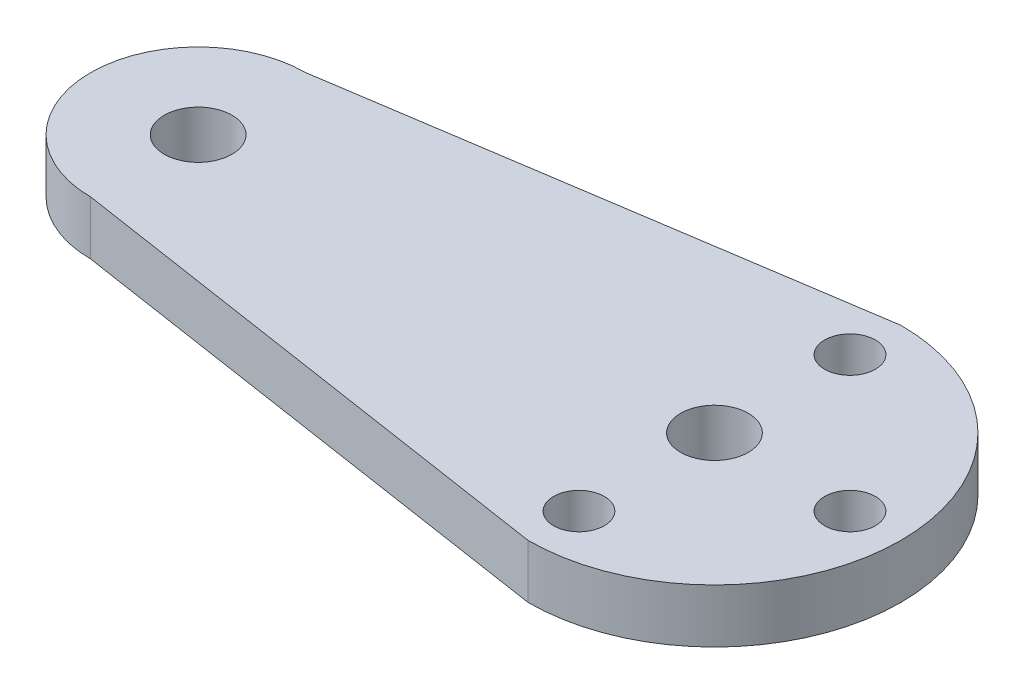
ISO-10303-21;
HEADER;
FILE_DESCRIPTION(('STEP AP214'),'2;1');
FILE_NAME('part.step','',(''),(''),'','','');
FILE_SCHEMA(('AUTOMOTIVE_DESIGN { 1 0 10303 214 1 1 1 1 }'));
ENDSEC;
DATA;
#1=APPLICATION_CONTEXT('core data for automotive mechanical design processes');
#2=APPLICATION_PROTOCOL_DEFINITION('international standard','automotive_design',2000,#1);
#3=PRODUCT_CONTEXT('',#1,'mechanical');
#4=PRODUCT('Part','Part','',(#3));
#5=PRODUCT_RELATED_PRODUCT_CATEGORY('part','',(#4));
#6=PRODUCT_DEFINITION_FORMATION('','',#4);
#7=PRODUCT_DEFINITION_CONTEXT('part definition',#1,'design');
#8=PRODUCT_DEFINITION('design','',#6,#7);
#9=PRODUCT_DEFINITION_SHAPE('','',#8);
#10=(LENGTH_UNIT() NAMED_UNIT(*) SI_UNIT(.MILLI.,.METRE.));
#11=(NAMED_UNIT(*) PLANE_ANGLE_UNIT() SI_UNIT($,.RADIAN.));
#12=(NAMED_UNIT(*) SI_UNIT($,.STERADIAN.) SOLID_ANGLE_UNIT());
#13=UNCERTAINTY_MEASURE_WITH_UNIT(LENGTH_MEASURE(1.E-05),#10,'distance_accuracy_value','');
#14=(GEOMETRIC_REPRESENTATION_CONTEXT(3) GLOBAL_UNCERTAINTY_ASSIGNED_CONTEXT((#13)) GLOBAL_UNIT_ASSIGNED_CONTEXT((#10,
#11,#12)) REPRESENTATION_CONTEXT('',''));
#15=CARTESIAN_POINT('',(0.,0.,0.));
#16=DIRECTION('',(0.,0.,1.));
#17=DIRECTION('',(1.,0.,0.));
#18=AXIS2_PLACEMENT_3D('',#15,#16,#17);
#19=CARTESIAN_POINT('',(15.24,3.175,0.));
#20=DIRECTION('',(0.,1.,0.));
#21=DIRECTION('',(0.,0.,1.));
#22=AXIS2_PLACEMENT_3D('',#19,#20,#21);
#23=PLANE('',#22);
#24=CARTESIAN_POINT('',(23.24,3.175,0.));
#25=DIRECTION('',(0.,1.,0.));
#26=DIRECTION('',(0.,0.,1.));
#27=AXIS2_PLACEMENT_3D('',#24,#25,#26);
#28=CIRCLE('',#27,1.5);
#29=CARTESIAN_POINT('',(23.24,3.175,1.5));
#30=VERTEX_POINT('',#29);
#31=EDGE_CURVE('E131',#30,#30,#28,.T.);
#32=ORIENTED_EDGE('',*,*,#31,.F.);
#33=EDGE_LOOP('',(#32));
#34=FACE_BOUND('',#33,.T.);
#35=CARTESIAN_POINT('',(-15.24,3.175,0.));
#36=DIRECTION('',(0.,1.,0.));
#37=DIRECTION('',(0.,0.,1.));
#38=AXIS2_PLACEMENT_3D('',#35,#36,#37);
#39=CIRCLE('',#38,2.000000064);
#40=CARTESIAN_POINT('',(-15.24,3.175,2.000000064));
#41=VERTEX_POINT('',#40);
#42=EDGE_CURVE('E119',#41,#41,#39,.T.);
#43=ORIENTED_EDGE('',*,*,#42,.F.);
#44=EDGE_LOOP('',(#43));
#45=FACE_BOUND('',#44,.T.);
#46=CARTESIAN_POINT('',(15.24,3.175,0.));
#47=DIRECTION('',(0.,1.,0.));
#48=DIRECTION('',(0.,0.,1.));
#49=AXIS2_PLACEMENT_3D('',#46,#47,#48);
#50=CIRCLE('',#49,11.);
#51=CARTESIAN_POINT('',(15.24,3.175,11.));
#52=VERTEX_POINT('',#51);
#53=CARTESIAN_POINT('',(15.24,3.175,-11.));
#54=VERTEX_POINT('',#53);
#55=EDGE_CURVE('E89',#52,#54,#50,.T.);
#56=ORIENTED_EDGE('',*,*,#55,.T.);
#57=DIRECTION('',(-0.988562140389916,0.,0.150814106063422));
#58=VECTOR('',#57,1.);
#59=CARTESIAN_POINT('',(-15.24,3.175,-6.35));
#60=LINE('',#59,#58);
#61=CARTESIAN_POINT('',(-15.24,3.175,-6.35));
#62=VERTEX_POINT('',#61);
#63=EDGE_CURVE('E84',#54,#62,#60,.T.);
#64=ORIENTED_EDGE('',*,*,#63,.T.);
#65=CARTESIAN_POINT('',(-15.24,3.175,0.));
#66=DIRECTION('',(0.,1.,0.));
#67=DIRECTION('',(0.,0.,-1.));
#68=AXIS2_PLACEMENT_3D('',#65,#66,#67);
#69=CIRCLE('',#68,6.35);
#70=CARTESIAN_POINT('',(-15.24,3.175,6.35));
#71=VERTEX_POINT('',#70);
#72=EDGE_CURVE('E87',#62,#71,#69,.T.);
#73=ORIENTED_EDGE('',*,*,#72,.T.);
#74=DIRECTION('',(0.988562140389916,0.,0.150814106063422));
#75=VECTOR('',#74,1.);
#76=CARTESIAN_POINT('',(15.24,3.175,11.));
#77=LINE('',#76,#75);
#78=EDGE_CURVE('E54',#71,#52,#77,.T.);
#79=ORIENTED_EDGE('',*,*,#78,.T.);
#80=EDGE_LOOP('',(#56,#64,#73,#79));
#81=FACE_BOUND('',#80,.T.);
#82=CARTESIAN_POINT('',(15.24,3.175,-8.00000000000001));
#83=DIRECTION('',(0.,1.,0.));
#84=DIRECTION('',(0.,0.,1.));
#85=AXIS2_PLACEMENT_3D('',#82,#83,#84);
#86=CIRCLE('',#85,1.5);
#87=CARTESIAN_POINT('',(15.24,3.175,-6.50000000000001));
#88=VERTEX_POINT('',#87);
#89=EDGE_CURVE('E104',#88,#88,#86,.T.);
#90=ORIENTED_EDGE('',*,*,#89,.F.);
#91=EDGE_LOOP('',(#90));
#92=FACE_BOUND('',#91,.T.);
#93=CARTESIAN_POINT('',(15.24,3.175,0.));
#94=DIRECTION('',(0.,1.,0.));
#95=DIRECTION('',(0.,0.,1.));
#96=AXIS2_PLACEMENT_3D('',#93,#94,#95);
#97=CIRCLE('',#96,2.000000064);
#98=CARTESIAN_POINT('',(15.24,3.175,2.000000064));
#99=VERTEX_POINT('',#98);
#100=EDGE_CURVE('E125',#99,#99,#97,.T.);
#101=ORIENTED_EDGE('',*,*,#100,.F.);
#102=EDGE_LOOP('',(#101));
#103=FACE_BOUND('',#102,.T.);
#104=CARTESIAN_POINT('',(15.24,3.175,7.99999999999999));
#105=DIRECTION('',(0.,1.,0.));
#106=DIRECTION('',(0.,0.,1.));
#107=AXIS2_PLACEMENT_3D('',#104,#105,#106);
#108=CIRCLE('',#107,1.5);
#109=CARTESIAN_POINT('',(15.24,3.175,9.49999999999999));
#110=VERTEX_POINT('',#109);
#111=EDGE_CURVE('E137',#110,#110,#108,.T.);
#112=ORIENTED_EDGE('',*,*,#111,.F.);
#113=EDGE_LOOP('',(#112));
#114=FACE_BOUND('',#113,.T.);
#115=ADVANCED_FACE('F37',(#34,#45,#81,#92,#103,#114),#23,.T.);
#116=CARTESIAN_POINT('',(15.24,0.,0.));
#117=DIRECTION('',(0.,1.,0.));
#118=DIRECTION('',(0.,0.,1.));
#119=AXIS2_PLACEMENT_3D('',#116,#117,#118);
#120=PLANE('',#119);
#121=CARTESIAN_POINT('',(15.24,0.,0.));
#122=DIRECTION('',(0.,1.,0.));
#123=DIRECTION('',(0.,0.,1.));
#124=AXIS2_PLACEMENT_3D('',#121,#122,#123);
#125=CIRCLE('',#124,11.);
#126=CARTESIAN_POINT('',(15.24,0.,11.));
#127=VERTEX_POINT('',#126);
#128=CARTESIAN_POINT('',(15.24,0.,-11.));
#129=VERTEX_POINT('',#128);
#130=EDGE_CURVE('E101',#127,#129,#125,.T.);
#131=ORIENTED_EDGE('',*,*,#130,.F.);
#132=DIRECTION('',(0.988562140389916,0.,0.150814106063422));
#133=VECTOR('',#132,1.);
#134=CARTESIAN_POINT('',(15.24,0.,11.));
#135=LINE('',#134,#133);
#136=CARTESIAN_POINT('',(-15.24,0.,6.35));
#137=VERTEX_POINT('',#136);
#138=EDGE_CURVE('E77',#137,#127,#135,.T.);
#139=ORIENTED_EDGE('',*,*,#138,.F.);
#140=CARTESIAN_POINT('',(-15.24,0.,0.));
#141=DIRECTION('',(0.,1.,0.));
#142=DIRECTION('',(0.,0.,-1.));
#143=AXIS2_PLACEMENT_3D('',#140,#141,#142);
#144=CIRCLE('',#143,6.35);
#145=CARTESIAN_POINT('',(-15.24,0.,-6.35));
#146=VERTEX_POINT('',#145);
#147=EDGE_CURVE('E71',#146,#137,#144,.T.);
#148=ORIENTED_EDGE('',*,*,#147,.F.);
#149=DIRECTION('',(-0.988562140389916,0.,0.150814106063422));
#150=VECTOR('',#149,1.);
#151=CARTESIAN_POINT('',(-15.24,0.,-6.35));
#152=LINE('',#151,#150);
#153=EDGE_CURVE('E93',#129,#146,#152,.T.);
#154=ORIENTED_EDGE('',*,*,#153,.F.);
#155=EDGE_LOOP('',(#131,#139,#148,#154));
#156=FACE_BOUND('',#155,.T.);
#157=CARTESIAN_POINT('',(15.24,0.,-8.00000000000001));
#158=DIRECTION('',(0.,1.,0.));
#159=DIRECTION('',(0.,0.,1.));
#160=AXIS2_PLACEMENT_3D('',#157,#158,#159);
#161=CIRCLE('',#160,1.5);
#162=CARTESIAN_POINT('',(15.24,0.,-6.50000000000001));
#163=VERTEX_POINT('',#162);
#164=EDGE_CURVE('E116',#163,#163,#161,.T.);
#165=ORIENTED_EDGE('',*,*,#164,.T.);
#166=EDGE_LOOP('',(#165));
#167=FACE_BOUND('',#166,.T.);
#168=CARTESIAN_POINT('',(-15.24,0.,0.));
#169=DIRECTION('',(0.,1.,0.));
#170=DIRECTION('',(0.,0.,1.));
#171=AXIS2_PLACEMENT_3D('',#168,#169,#170);
#172=CIRCLE('',#171,2.000000064);
#173=CARTESIAN_POINT('',(-15.24,0.,2.000000064));
#174=VERTEX_POINT('',#173);
#175=EDGE_CURVE('E122',#174,#174,#172,.T.);
#176=ORIENTED_EDGE('',*,*,#175,.T.);
#177=EDGE_LOOP('',(#176));
#178=FACE_BOUND('',#177,.T.);
#179=CARTESIAN_POINT('',(15.24,0.,0.));
#180=DIRECTION('',(0.,1.,0.));
#181=DIRECTION('',(0.,0.,1.));
#182=AXIS2_PLACEMENT_3D('',#179,#180,#181);
#183=CIRCLE('',#182,2.000000064);
#184=CARTESIAN_POINT('',(15.24,0.,2.000000064));
#185=VERTEX_POINT('',#184);
#186=EDGE_CURVE('E128',#185,#185,#183,.T.);
#187=ORIENTED_EDGE('',*,*,#186,.T.);
#188=EDGE_LOOP('',(#187));
#189=FACE_BOUND('',#188,.T.);
#190=CARTESIAN_POINT('',(23.24,0.,0.));
#191=DIRECTION('',(0.,1.,0.));
#192=DIRECTION('',(0.,0.,1.));
#193=AXIS2_PLACEMENT_3D('',#190,#191,#192);
#194=CIRCLE('',#193,1.5);
#195=CARTESIAN_POINT('',(23.24,0.,1.5));
#196=VERTEX_POINT('',#195);
#197=EDGE_CURVE('E134',#196,#196,#194,.T.);
#198=ORIENTED_EDGE('',*,*,#197,.T.);
#199=EDGE_LOOP('',(#198));
#200=FACE_BOUND('',#199,.T.);
#201=CARTESIAN_POINT('',(15.24,0.,7.99999999999999));
#202=DIRECTION('',(0.,1.,0.));
#203=DIRECTION('',(0.,0.,1.));
#204=AXIS2_PLACEMENT_3D('',#201,#202,#203);
#205=CIRCLE('',#204,1.5);
#206=CARTESIAN_POINT('',(15.24,0.,9.49999999999999));
#207=VERTEX_POINT('',#206);
#208=EDGE_CURVE('E140',#207,#207,#205,.T.);
#209=ORIENTED_EDGE('',*,*,#208,.T.);
#210=EDGE_LOOP('',(#209));
#211=FACE_BOUND('',#210,.T.);
#212=ADVANCED_FACE('F112',(#156,#167,#178,#189,#200,#211),#120,.F.);
#213=CARTESIAN_POINT('',(15.24,3.175,0.));
#214=DIRECTION('',(0.,-1.,0.));
#215=DIRECTION('',(0.,0.,-1.));
#216=AXIS2_PLACEMENT_3D('',#213,#214,#215);
#217=CYLINDRICAL_SURFACE('',#216,11.);
#218=ORIENTED_EDGE('',*,*,#130,.T.);
#219=DIRECTION('',(0.,-1.,0.));
#220=VECTOR('',#219,1.);
#221=CARTESIAN_POINT('',(15.24,3.175,-11.));
#222=LINE('',#221,#220);
#223=EDGE_CURVE('E11',#54,#129,#222,.T.);
#224=ORIENTED_EDGE('',*,*,#223,.F.);
#225=ORIENTED_EDGE('',*,*,#55,.F.);
#226=DIRECTION('',(0.,-1.,0.));
#227=VECTOR('',#226,1.);
#228=CARTESIAN_POINT('',(15.24,3.175,11.));
#229=LINE('',#228,#227);
#230=EDGE_CURVE('E97',#52,#127,#229,.T.);
#231=ORIENTED_EDGE('',*,*,#230,.T.);
#232=EDGE_LOOP('',(#218,#224,#225,#231));
#233=FACE_BOUND('',#232,.T.);
#234=ADVANCED_FACE('F39',(#233),#217,.T.);
#235=CARTESIAN_POINT('',(-15.24,3.175,-6.35));
#236=DIRECTION('',(0.150814106063422,0.,0.988562140389915));
#237=DIRECTION('',(0.988562140389916,0.,-0.150814106063422));
#238=AXIS2_PLACEMENT_3D('',#235,#236,#237);
#239=PLANE('',#238);
#240=ORIENTED_EDGE('',*,*,#153,.T.);
#241=DIRECTION('',(0.,-1.,0.));
#242=VECTOR('',#241,1.);
#243=CARTESIAN_POINT('',(-15.24,3.175,-6.35));
#244=LINE('',#243,#242);
#245=EDGE_CURVE('E46',#62,#146,#244,.T.);
#246=ORIENTED_EDGE('',*,*,#245,.F.);
#247=ORIENTED_EDGE('',*,*,#63,.F.);
#248=ORIENTED_EDGE('',*,*,#223,.T.);
#249=EDGE_LOOP('',(#240,#246,#247,#248));
#250=FACE_BOUND('',#249,.T.);
#251=ADVANCED_FACE('F92',(#250),#239,.F.);
#252=CARTESIAN_POINT('',(-15.24,3.175,0.));
#253=DIRECTION('',(0.,-1.,0.));
#254=DIRECTION('',(0.,0.,-1.));
#255=AXIS2_PLACEMENT_3D('',#252,#253,#254);
#256=CYLINDRICAL_SURFACE('',#255,6.35);
#257=ORIENTED_EDGE('',*,*,#147,.T.);
#258=DIRECTION('',(0.,-1.,0.));
#259=VECTOR('',#258,1.);
#260=CARTESIAN_POINT('',(-15.24,3.175,6.35));
#261=LINE('',#260,#259);
#262=EDGE_CURVE('E94',#71,#137,#261,.T.);
#263=ORIENTED_EDGE('',*,*,#262,.F.);
#264=ORIENTED_EDGE('',*,*,#72,.F.);
#265=ORIENTED_EDGE('',*,*,#245,.T.);
#266=EDGE_LOOP('',(#257,#263,#264,#265));
#267=FACE_BOUND('',#266,.T.);
#268=ADVANCED_FACE('F95',(#267),#256,.T.);
#269=CARTESIAN_POINT('',(15.24,3.175,11.));
#270=DIRECTION('',(0.150814106063422,0.,-0.988562140389915));
#271=DIRECTION('',(-0.988562140389916,0.,-0.150814106063422));
#272=AXIS2_PLACEMENT_3D('',#269,#270,#271);
#273=PLANE('',#272);
#274=ORIENTED_EDGE('',*,*,#138,.T.);
#275=ORIENTED_EDGE('',*,*,#230,.F.);
#276=ORIENTED_EDGE('',*,*,#78,.F.);
#277=ORIENTED_EDGE('',*,*,#262,.T.);
#278=EDGE_LOOP('',(#274,#275,#276,#277));
#279=FACE_BOUND('',#278,.T.);
#280=ADVANCED_FACE('F109',(#279),#273,.F.);
#281=CARTESIAN_POINT('',(15.24,3.175,-8.00000000000001));
#282=DIRECTION('',(0.,-1.,0.));
#283=DIRECTION('',(0.,0.,-1.));
#284=AXIS2_PLACEMENT_3D('',#281,#282,#283);
#285=CYLINDRICAL_SURFACE('',#284,1.5);
#286=ORIENTED_EDGE('',*,*,#89,.T.);
#287=EDGE_LOOP('',(#286));
#288=FACE_BOUND('',#287,.T.);
#289=ORIENTED_EDGE('',*,*,#164,.F.);
#290=EDGE_LOOP('',(#289));
#291=FACE_BOUND('',#290,.T.);
#292=ADVANCED_FACE('F159',(#288,#291),#285,.F.);
#293=CARTESIAN_POINT('',(-15.24,3.175,0.));
#294=DIRECTION('',(0.,-1.,0.));
#295=DIRECTION('',(0.,0.,-1.));
#296=AXIS2_PLACEMENT_3D('',#293,#294,#295);
#297=CYLINDRICAL_SURFACE('',#296,2.000000064);
#298=ORIENTED_EDGE('',*,*,#42,.T.);
#299=EDGE_LOOP('',(#298));
#300=FACE_BOUND('',#299,.T.);
#301=ORIENTED_EDGE('',*,*,#175,.F.);
#302=EDGE_LOOP('',(#301));
#303=FACE_BOUND('',#302,.T.);
#304=ADVANCED_FACE('F213',(#300,#303),#297,.F.);
#305=CARTESIAN_POINT('',(15.24,3.175,0.));
#306=DIRECTION('',(0.,-1.,0.));
#307=DIRECTION('',(0.,0.,-1.));
#308=AXIS2_PLACEMENT_3D('',#305,#306,#307);
#309=CYLINDRICAL_SURFACE('',#308,2.000000064);
#310=ORIENTED_EDGE('',*,*,#100,.T.);
#311=EDGE_LOOP('',(#310));
#312=FACE_BOUND('',#311,.T.);
#313=ORIENTED_EDGE('',*,*,#186,.F.);
#314=EDGE_LOOP('',(#313));
#315=FACE_BOUND('',#314,.T.);
#316=ADVANCED_FACE('F222',(#312,#315),#309,.F.);
#317=CARTESIAN_POINT('',(23.24,3.175,0.));
#318=DIRECTION('',(0.,-1.,0.));
#319=DIRECTION('',(0.,0.,-1.));
#320=AXIS2_PLACEMENT_3D('',#317,#318,#319);
#321=CYLINDRICAL_SURFACE('',#320,1.5);
#322=ORIENTED_EDGE('',*,*,#31,.T.);
#323=EDGE_LOOP('',(#322));
#324=FACE_BOUND('',#323,.T.);
#325=ORIENTED_EDGE('',*,*,#197,.F.);
#326=EDGE_LOOP('',(#325));
#327=FACE_BOUND('',#326,.T.);
#328=ADVANCED_FACE('F231',(#324,#327),#321,.F.);
#329=CARTESIAN_POINT('',(15.24,3.175,7.99999999999999));
#330=DIRECTION('',(0.,-1.,0.));
#331=DIRECTION('',(0.,0.,-1.));
#332=AXIS2_PLACEMENT_3D('',#329,#330,#331);
#333=CYLINDRICAL_SURFACE('',#332,1.5);
#334=ORIENTED_EDGE('',*,*,#111,.T.);
#335=EDGE_LOOP('',(#334));
#336=FACE_BOUND('',#335,.T.);
#337=ORIENTED_EDGE('',*,*,#208,.F.);
#338=EDGE_LOOP('',(#337));
#339=FACE_BOUND('',#338,.T.);
#340=ADVANCED_FACE('F146',(#336,#339),#333,.F.);
#341=CLOSED_SHELL('',(#115,#212,#234,#251,#268,#280,#292,#304,#316,#328,#340));
#342=MANIFOLD_SOLID_BREP('B2',#341);
#343=ADVANCED_BREP_SHAPE_REPRESENTATION('',(#18,#342),#14);
#344=SHAPE_DEFINITION_REPRESENTATION(#9,#343);
ENDSEC;
END-ISO-10303-21;
